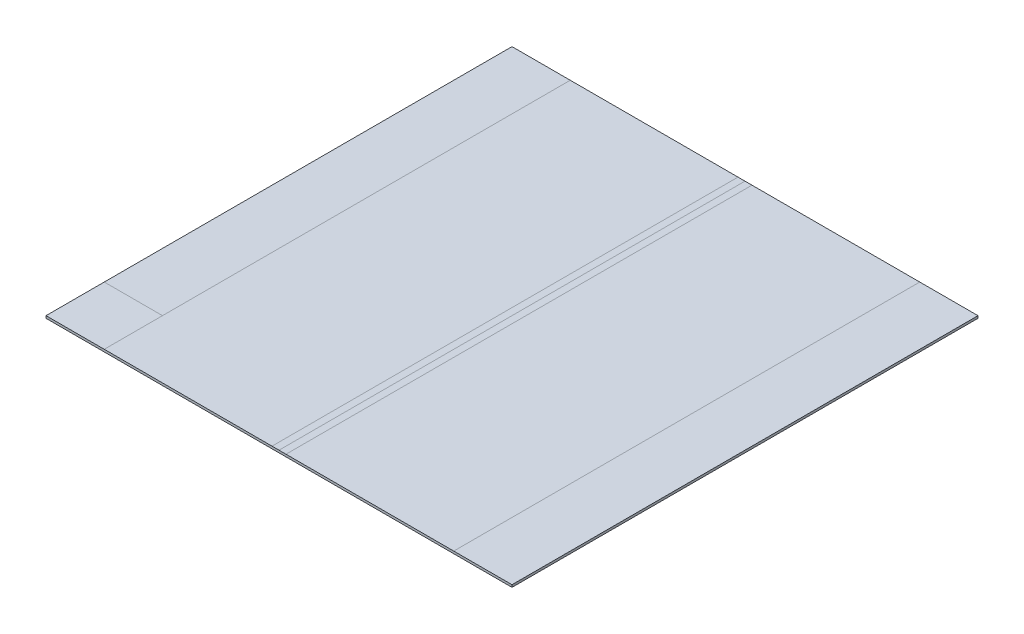
ISO-10303-21;
HEADER;
FILE_DESCRIPTION(('STEP AP214'),'2;1');
FILE_NAME('part.step','',(''),(''),'','','');
FILE_SCHEMA(('AUTOMOTIVE_DESIGN { 1 0 10303 214 1 1 1 1 }'));
ENDSEC;
DATA;
#1=APPLICATION_CONTEXT('core data for automotive mechanical design processes');
#2=APPLICATION_PROTOCOL_DEFINITION('international standard','automotive_design',2000,#1);
#3=PRODUCT_CONTEXT('',#1,'mechanical');
#4=PRODUCT('Part','Part','',(#3));
#5=PRODUCT_RELATED_PRODUCT_CATEGORY('part','',(#4));
#6=PRODUCT_DEFINITION_FORMATION('','',#4);
#7=PRODUCT_DEFINITION_CONTEXT('part definition',#1,'design');
#8=PRODUCT_DEFINITION('design','',#6,#7);
#9=PRODUCT_DEFINITION_SHAPE('','',#8);
#10=(LENGTH_UNIT() NAMED_UNIT(*) SI_UNIT(.MILLI.,.METRE.));
#11=(NAMED_UNIT(*) PLANE_ANGLE_UNIT() SI_UNIT($,.RADIAN.));
#12=(NAMED_UNIT(*) SI_UNIT($,.STERADIAN.) SOLID_ANGLE_UNIT());
#13=UNCERTAINTY_MEASURE_WITH_UNIT(LENGTH_MEASURE(1.E-05),#10,'distance_accuracy_value','');
#14=(GEOMETRIC_REPRESENTATION_CONTEXT(3) GLOBAL_UNCERTAINTY_ASSIGNED_CONTEXT((#13)) GLOBAL_UNIT_ASSIGNED_CONTEXT((#10,
#11,#12)) REPRESENTATION_CONTEXT('',''));
#15=CARTESIAN_POINT('',(0.,0.,0.));
#16=DIRECTION('',(0.,0.,1.));
#17=DIRECTION('',(1.,0.,0.));
#18=AXIS2_PLACEMENT_3D('',#15,#16,#17);
#19=CARTESIAN_POINT('',(0.,5.,0.));
#20=DIRECTION('',(0.,1.,0.));
#21=DIRECTION('',(0.,0.,1.));
#22=AXIS2_PLACEMENT_3D('',#19,#20,#21);
#23=PLANE('',#22);
#24=DIRECTION('',(0.,0.,-1.));
#25=VECTOR('',#24,1.);
#26=CARTESIAN_POINT('',(-171.561604584527,5.,0.));
#27=LINE('',#26,#25);
#28=CARTESIAN_POINT('',(-171.561604584527,5.,440.54441260745));
#29=VERTEX_POINT('',#28);
#30=CARTESIAN_POINT('',(-171.561604584527,5.,315.54441260745));
#31=VERTEX_POINT('',#30);
#32=EDGE_CURVE('E154',#29,#31,#27,.T.);
#33=ORIENTED_EDGE('',*,*,#32,.T.);
#34=DIRECTION('',(-1.,0.,0.));
#35=VECTOR('',#34,1.);
#36=CARTESIAN_POINT('',(0.,5.,315.54441260745));
#37=LINE('',#36,#35);
#38=CARTESIAN_POINT('',(-296.561604584527,5.,315.54441260745));
#39=VERTEX_POINT('',#38);
#40=EDGE_CURVE('E11',#31,#39,#37,.T.);
#41=ORIENTED_EDGE('',*,*,#40,.T.);
#42=DIRECTION('',(0.,0.,-1.));
#43=VECTOR('',#42,1.);
#44=CARTESIAN_POINT('',(-296.561604584527,5.,0.));
#45=LINE('',#44,#43);
#46=CARTESIAN_POINT('',(-296.561604584527,5.,440.54441260745));
#47=VERTEX_POINT('',#46);
#48=EDGE_CURVE('E186',#47,#39,#45,.T.);
#49=ORIENTED_EDGE('',*,*,#48,.F.);
#50=DIRECTION('',(1.,0.,0.));
#51=VECTOR('',#50,1.);
#52=CARTESIAN_POINT('',(0.,5.,440.54441260745));
#53=LINE('',#52,#51);
#54=EDGE_CURVE('E142',#47,#29,#53,.T.);
#55=ORIENTED_EDGE('',*,*,#54,.T.);
#56=EDGE_LOOP('',(#33,#41,#49,#55));
#57=FACE_BOUND('',#56,.T.);
#58=ADVANCED_FACE('F42',(#57),#23,.T.);
#59=DIRECTION('',(1.,0.,0.));
#60=VECTOR('',#59,1.);
#61=CARTESIAN_POINT('',(0.,5.,-559.45558739255));
#62=LINE('',#61,#60);
#63=CARTESIAN_POINT('',(218.438395415473,5.,-559.45558739255));
#64=VERTEX_POINT('',#63);
#65=CARTESIAN_POINT('',(578.438395415473,5.,-559.45558739255));
#66=VERTEX_POINT('',#65);
#67=EDGE_CURVE('E169',#64,#66,#62,.T.);
#68=ORIENTED_EDGE('',*,*,#67,.F.);
#69=DIRECTION('',(0.,0.,1.));
#70=VECTOR('',#69,1.);
#71=CARTESIAN_POINT('',(218.438395415473,5.,0.));
#72=LINE('',#71,#70);
#73=CARTESIAN_POINT('',(218.438395415473,5.,440.54441260745));
#74=VERTEX_POINT('',#73);
#75=EDGE_CURVE('E51',#64,#74,#72,.T.);
#76=ORIENTED_EDGE('',*,*,#75,.T.);
#77=CARTESIAN_POINT('',(578.438395415473,5.,440.54441260745));
#78=VERTEX_POINT('',#77);
#79=EDGE_CURVE('E129',#74,#78,#53,.T.);
#80=ORIENTED_EDGE('',*,*,#79,.T.);
#81=DIRECTION('',(0.,0.,1.));
#82=VECTOR('',#81,1.);
#83=CARTESIAN_POINT('',(578.438395415473,5.,-1.28439124983498E-13));
#84=LINE('',#83,#82);
#85=EDGE_CURVE('E125',#66,#78,#84,.T.);
#86=ORIENTED_EDGE('',*,*,#85,.F.);
#87=EDGE_LOOP('',(#68,#76,#80,#86));
#88=FACE_BOUND('',#87,.T.);
#89=ADVANCED_FACE('F168',(#88),#23,.T.);
#90=CARTESIAN_POINT('',(188.438395415473,5.,440.54441260745));
#91=VERTEX_POINT('',#90);
#92=EDGE_CURVE('E132',#29,#91,#53,.T.);
#93=ORIENTED_EDGE('',*,*,#92,.T.);
#94=DIRECTION('',(0.,0.,-1.));
#95=VECTOR('',#94,1.);
#96=CARTESIAN_POINT('',(188.438395415473,5.,0.));
#97=LINE('',#96,#95);
#98=CARTESIAN_POINT('',(188.438395415473,5.,-559.45558739255));
#99=VERTEX_POINT('',#98);
#100=EDGE_CURVE('E161',#91,#99,#97,.T.);
#101=ORIENTED_EDGE('',*,*,#100,.T.);
#102=CARTESIAN_POINT('',(-171.561604584527,5.,-559.45558739255));
#103=VERTEX_POINT('',#102);
#104=EDGE_CURVE('E185',#103,#99,#62,.T.);
#105=ORIENTED_EDGE('',*,*,#104,.F.);
#106=EDGE_CURVE('E148',#31,#103,#27,.T.);
#107=ORIENTED_EDGE('',*,*,#106,.F.);
#108=ORIENTED_EDGE('',*,*,#32,.F.);
#109=EDGE_LOOP('',(#93,#101,#105,#107,#108));
#110=FACE_BOUND('',#109,.T.);
#111=ADVANCED_FACE('F221',(#110),#23,.T.);
#112=ORIENTED_EDGE('',*,*,#75,.F.);
#113=CARTESIAN_POINT('',(203.438395415473,5.,-559.45558739255));
#114=VERTEX_POINT('',#113);
#115=EDGE_CURVE('E396',#114,#64,#62,.T.);
#116=ORIENTED_EDGE('',*,*,#115,.F.);
#117=DIRECTION('',(0.,0.,1.));
#118=VECTOR('',#117,1.);
#119=CARTESIAN_POINT('',(203.438395415473,5.,0.));
#120=LINE('',#119,#118);
#121=CARTESIAN_POINT('',(203.438395415473,5.,440.54441260745));
#122=VERTEX_POINT('',#121);
#123=EDGE_CURVE('E157',#114,#122,#120,.T.);
#124=ORIENTED_EDGE('',*,*,#123,.T.);
#125=EDGE_CURVE('E133',#122,#74,#53,.T.);
#126=ORIENTED_EDGE('',*,*,#125,.T.);
#127=EDGE_LOOP('',(#112,#116,#124,#126));
#128=FACE_BOUND('',#127,.T.);
#129=ADVANCED_FACE('F177',(#128),#23,.T.);
#130=ORIENTED_EDGE('',*,*,#40,.F.);
#131=ORIENTED_EDGE('',*,*,#106,.T.);
#132=CARTESIAN_POINT('',(-296.561604584527,5.,-559.45558739255));
#133=VERTEX_POINT('',#132);
#134=EDGE_CURVE('E181',#133,#103,#62,.T.);
#135=ORIENTED_EDGE('',*,*,#134,.F.);
#136=EDGE_CURVE('E184',#39,#133,#45,.T.);
#137=ORIENTED_EDGE('',*,*,#136,.F.);
#138=EDGE_LOOP('',(#130,#131,#135,#137));
#139=FACE_BOUND('',#138,.T.);
#140=ADVANCED_FACE('F230',(#139),#23,.T.);
#141=CARTESIAN_POINT('',(703.438395415473,5.,-559.45558739255));
#142=VERTEX_POINT('',#141);
#143=EDGE_CURVE('E141',#66,#142,#62,.T.);
#144=ORIENTED_EDGE('',*,*,#143,.F.);
#145=ORIENTED_EDGE('',*,*,#85,.T.);
#146=CARTESIAN_POINT('',(703.438395415473,5.,440.54441260745));
#147=VERTEX_POINT('',#146);
#148=EDGE_CURVE('E118',#78,#147,#53,.T.);
#149=ORIENTED_EDGE('',*,*,#148,.T.);
#150=DIRECTION('',(0.,0.,-1.));
#151=VECTOR('',#150,1.);
#152=CARTESIAN_POINT('',(703.438395415473,5.,0.));
#153=LINE('',#152,#151);
#154=EDGE_CURVE('E122',#147,#142,#153,.T.);
#155=ORIENTED_EDGE('',*,*,#154,.T.);
#156=EDGE_LOOP('',(#144,#145,#149,#155));
#157=FACE_BOUND('',#156,.T.);
#158=ADVANCED_FACE('F121',(#157),#23,.T.);
#159=CARTESIAN_POINT('',(0.,5.,440.54441260745));
#160=DIRECTION('',(0.,0.,-1.));
#161=DIRECTION('',(-1.,0.,0.));
#162=AXIS2_PLACEMENT_3D('',#159,#160,#161);
#163=PLANE('',#162);
#164=DIRECTION('',(1.,0.,0.));
#165=VECTOR('',#164,1.);
#166=CARTESIAN_POINT('',(0.,0.,440.54441260745));
#167=LINE('',#166,#165);
#168=CARTESIAN_POINT('',(-296.561604584527,0.,440.54441260745));
#169=VERTEX_POINT('',#168);
#170=CARTESIAN_POINT('',(703.438395415473,0.,440.54441260745));
#171=VERTEX_POINT('',#170);
#172=EDGE_CURVE('E145',#169,#171,#167,.T.);
#173=ORIENTED_EDGE('',*,*,#172,.T.);
#174=DIRECTION('',(0.,-1.,0.));
#175=VECTOR('',#174,1.);
#176=CARTESIAN_POINT('',(703.438395415473,5.,440.54441260745));
#177=LINE('',#176,#175);
#178=EDGE_CURVE('E138',#147,#171,#177,.T.);
#179=ORIENTED_EDGE('',*,*,#178,.F.);
#180=ORIENTED_EDGE('',*,*,#148,.F.);
#181=ORIENTED_EDGE('',*,*,#79,.F.);
#182=ORIENTED_EDGE('',*,*,#125,.F.);
#183=EDGE_CURVE('E176',#91,#122,#53,.T.);
#184=ORIENTED_EDGE('',*,*,#183,.F.);
#185=ORIENTED_EDGE('',*,*,#92,.F.);
#186=ORIENTED_EDGE('',*,*,#54,.F.);
#187=DIRECTION('',(0.,-1.,0.));
#188=VECTOR('',#187,1.);
#189=CARTESIAN_POINT('',(-296.561604584527,5.,440.54441260745));
#190=LINE('',#189,#188);
#191=EDGE_CURVE('E189',#47,#169,#190,.T.);
#192=ORIENTED_EDGE('',*,*,#191,.T.);
#193=EDGE_LOOP('',(#173,#179,#180,#181,#182,#184,#185,#186,#192));
#194=FACE_BOUND('',#193,.T.);
#195=ADVANCED_FACE('F44',(#194),#163,.F.);
#196=CARTESIAN_POINT('',(703.438395415473,5.,0.));
#197=DIRECTION('',(-1.,0.,0.));
#198=DIRECTION('',(0.,0.,1.));
#199=AXIS2_PLACEMENT_3D('',#196,#197,#198);
#200=PLANE('',#199);
#201=DIRECTION('',(0.,0.,-1.));
#202=VECTOR('',#201,1.);
#203=CARTESIAN_POINT('',(703.438395415473,0.,0.));
#204=LINE('',#203,#202);
#205=CARTESIAN_POINT('',(703.438395415473,0.,-559.45558739255));
#206=VERTEX_POINT('',#205);
#207=EDGE_CURVE('E191',#171,#206,#204,.T.);
#208=ORIENTED_EDGE('',*,*,#207,.T.);
#209=DIRECTION('',(0.,-1.,0.));
#210=VECTOR('',#209,1.);
#211=CARTESIAN_POINT('',(703.438395415473,5.,-559.45558739255));
#212=LINE('',#211,#210);
#213=EDGE_CURVE('E140',#142,#206,#212,.T.);
#214=ORIENTED_EDGE('',*,*,#213,.F.);
#215=ORIENTED_EDGE('',*,*,#154,.F.);
#216=ORIENTED_EDGE('',*,*,#178,.T.);
#217=EDGE_LOOP('',(#208,#214,#215,#216));
#218=FACE_BOUND('',#217,.T.);
#219=ADVANCED_FACE('F137',(#218),#200,.F.);
#220=CARTESIAN_POINT('',(0.,5.,-559.45558739255));
#221=DIRECTION('',(0.,0.,-1.));
#222=DIRECTION('',(-1.,0.,0.));
#223=AXIS2_PLACEMENT_3D('',#220,#221,#222);
#224=PLANE('',#223);
#225=DIRECTION('',(1.,0.,0.));
#226=VECTOR('',#225,1.);
#227=CARTESIAN_POINT('',(0.,0.,-559.45558739255));
#228=LINE('',#227,#226);
#229=CARTESIAN_POINT('',(-296.561604584527,0.,-559.45558739255));
#230=VERTEX_POINT('',#229);
#231=EDGE_CURVE('E193',#230,#206,#228,.T.);
#232=ORIENTED_EDGE('',*,*,#231,.F.);
#233=DIRECTION('',(0.,-1.,0.));
#234=VECTOR('',#233,1.);
#235=CARTESIAN_POINT('',(-296.561604584527,5.,-559.45558739255));
#236=LINE('',#235,#234);
#237=EDGE_CURVE('E150',#133,#230,#236,.T.);
#238=ORIENTED_EDGE('',*,*,#237,.F.);
#239=ORIENTED_EDGE('',*,*,#134,.T.);
#240=ORIENTED_EDGE('',*,*,#104,.T.);
#241=EDGE_CURVE('E228',#99,#114,#62,.T.);
#242=ORIENTED_EDGE('',*,*,#241,.T.);
#243=ORIENTED_EDGE('',*,*,#115,.T.);
#244=ORIENTED_EDGE('',*,*,#67,.T.);
#245=ORIENTED_EDGE('',*,*,#143,.T.);
#246=ORIENTED_EDGE('',*,*,#213,.T.);
#247=EDGE_LOOP('',(#232,#238,#239,#240,#242,#243,#244,#245,#246));
#248=FACE_BOUND('',#247,.T.);
#249=ADVANCED_FACE('F205',(#248),#224,.T.);
#250=CARTESIAN_POINT('',(-296.561604584527,5.,0.));
#251=DIRECTION('',(-1.,0.,0.));
#252=DIRECTION('',(0.,0.,1.));
#253=AXIS2_PLACEMENT_3D('',#250,#251,#252);
#254=PLANE('',#253);
#255=DIRECTION('',(0.,0.,-1.));
#256=VECTOR('',#255,1.);
#257=CARTESIAN_POINT('',(-296.561604584527,0.,0.));
#258=LINE('',#257,#256);
#259=EDGE_CURVE('E130',#169,#230,#258,.T.);
#260=ORIENTED_EDGE('',*,*,#259,.F.);
#261=ORIENTED_EDGE('',*,*,#191,.F.);
#262=ORIENTED_EDGE('',*,*,#48,.T.);
#263=ORIENTED_EDGE('',*,*,#136,.T.);
#264=ORIENTED_EDGE('',*,*,#237,.T.);
#265=EDGE_LOOP('',(#260,#261,#262,#263,#264));
#266=FACE_BOUND('',#265,.T.);
#267=ADVANCED_FACE('F202',(#266),#254,.T.);
#268=ORIENTED_EDGE('',*,*,#100,.F.);
#269=ORIENTED_EDGE('',*,*,#183,.T.);
#270=ORIENTED_EDGE('',*,*,#123,.F.);
#271=ORIENTED_EDGE('',*,*,#241,.F.);
#272=EDGE_LOOP('',(#268,#269,#270,#271));
#273=FACE_BOUND('',#272,.T.);
#274=ADVANCED_FACE('F209',(#273),#23,.T.);
#275=CARTESIAN_POINT('',(0.,0.,0.));
#276=DIRECTION('',(0.,1.,0.));
#277=DIRECTION('',(0.,0.,1.));
#278=AXIS2_PLACEMENT_3D('',#275,#276,#277);
#279=PLANE('',#278);
#280=ORIENTED_EDGE('',*,*,#172,.F.);
#281=ORIENTED_EDGE('',*,*,#259,.T.);
#282=ORIENTED_EDGE('',*,*,#231,.T.);
#283=ORIENTED_EDGE('',*,*,#207,.F.);
#284=EDGE_LOOP('',(#280,#281,#282,#283));
#285=FACE_BOUND('',#284,.T.);
#286=ADVANCED_FACE('F207',(#285),#279,.F.);
#287=CLOSED_SHELL('',(#58,#89,#111,#129,#140,#158,#195,#219,#249,#267,#274,#286));
#288=MANIFOLD_SOLID_BREP('B2',#287);
#289=ADVANCED_BREP_SHAPE_REPRESENTATION('',(#18,#288),#14);
#290=SHAPE_DEFINITION_REPRESENTATION(#9,#289);
ENDSEC;
END-ISO-10303-21;
